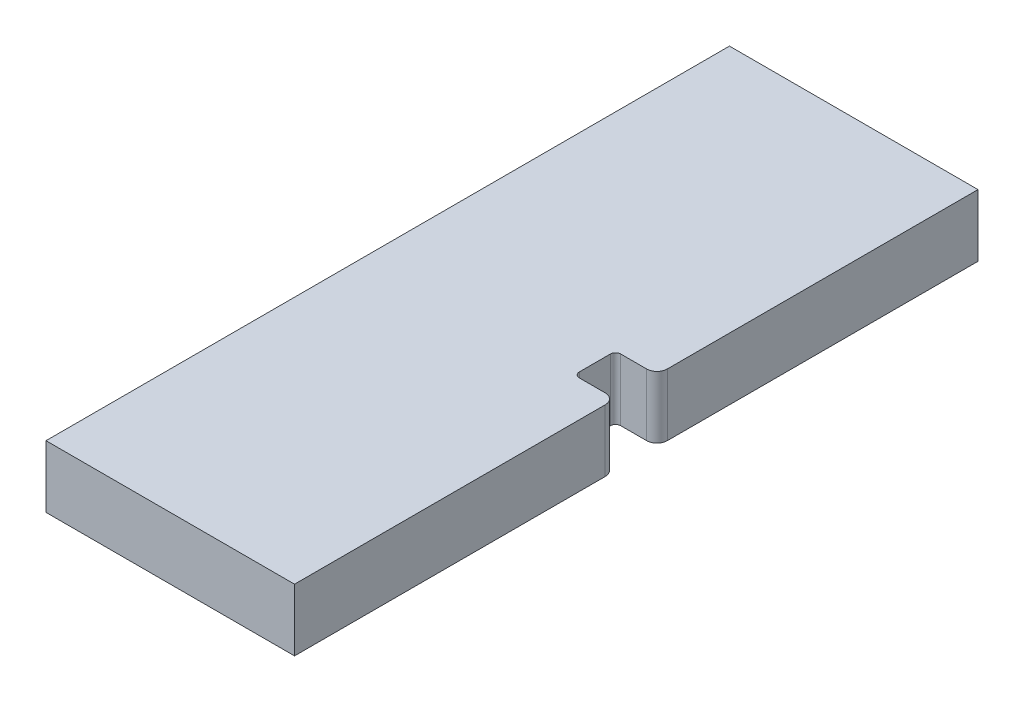
ISO-10303-21;
HEADER;
FILE_DESCRIPTION(('STEP AP214'),'2;1');
FILE_NAME('part.step','',(''),(''),'','','');
FILE_SCHEMA(('AUTOMOTIVE_DESIGN { 1 0 10303 214 1 1 1 1 }'));
ENDSEC;
DATA;
#1=APPLICATION_CONTEXT('core data for automotive mechanical design processes');
#2=APPLICATION_PROTOCOL_DEFINITION('international standard','automotive_design',2000,#1);
#3=PRODUCT_CONTEXT('',#1,'mechanical');
#4=PRODUCT('Part','Part','',(#3));
#5=PRODUCT_RELATED_PRODUCT_CATEGORY('part','',(#4));
#6=PRODUCT_DEFINITION_FORMATION('','',#4);
#7=PRODUCT_DEFINITION_CONTEXT('part definition',#1,'design');
#8=PRODUCT_DEFINITION('design','',#6,#7);
#9=PRODUCT_DEFINITION_SHAPE('','',#8);
#10=(LENGTH_UNIT() NAMED_UNIT(*) SI_UNIT(.MILLI.,.METRE.));
#11=(NAMED_UNIT(*) PLANE_ANGLE_UNIT() SI_UNIT($,.RADIAN.));
#12=(NAMED_UNIT(*) SI_UNIT($,.STERADIAN.) SOLID_ANGLE_UNIT());
#13=UNCERTAINTY_MEASURE_WITH_UNIT(LENGTH_MEASURE(1.E-05),#10,'distance_accuracy_value','');
#14=(GEOMETRIC_REPRESENTATION_CONTEXT(3) GLOBAL_UNCERTAINTY_ASSIGNED_CONTEXT((#13)) GLOBAL_UNIT_ASSIGNED_CONTEXT((#10,
#11,#12)) REPRESENTATION_CONTEXT('',''));
#15=CARTESIAN_POINT('',(0.,0.,0.));
#16=DIRECTION('',(0.,0.,1.));
#17=DIRECTION('',(1.,0.,0.));
#18=AXIS2_PLACEMENT_3D('',#15,#16,#17);
#19=CARTESIAN_POINT('',(20.295,5.17,5.775));
#20=DIRECTION('',(0.,-1.,0.));
#21=DIRECTION('',(0.,0.,-1.));
#22=AXIS2_PLACEMENT_3D('',#19,#20,#21);
#23=CYLINDRICAL_SURFACE('',#22,0.025);
#24=DIRECTION('',(0.,1.,0.));
#25=VECTOR('',#24,1.);
#26=CARTESIAN_POINT('',(20.295,5.17,5.8));
#27=LINE('',#26,#25);
#28=CARTESIAN_POINT('',(20.295,5.17,5.8));
#29=VERTEX_POINT('',#28);
#30=CARTESIAN_POINT('',(20.295,4.87,5.8));
#31=VERTEX_POINT('',#30);
#32=EDGE_CURVE('E186',#29,#31,#27,.F.);
#33=ORIENTED_EDGE('',*,*,#32,.T.);
#34=CARTESIAN_POINT('',(20.295,4.87,5.775));
#35=DIRECTION('',(0.,-1.,0.));
#36=DIRECTION('',(0.,0.,-1.));
#37=AXIS2_PLACEMENT_3D('',#34,#35,#36);
#38=CIRCLE('',#37,0.025);
#39=CARTESIAN_POINT('',(20.27,4.87,5.775));
#40=VERTEX_POINT('',#39);
#41=EDGE_CURVE('E215',#31,#40,#38,.T.);
#42=ORIENTED_EDGE('',*,*,#41,.T.);
#43=DIRECTION('',(0.,1.,0.));
#44=VECTOR('',#43,1.);
#45=CARTESIAN_POINT('',(20.27,5.17,5.775));
#46=LINE('',#45,#44);
#47=CARTESIAN_POINT('',(20.27,5.17,5.775));
#48=VERTEX_POINT('',#47);
#49=EDGE_CURVE('E185',#40,#48,#46,.T.);
#50=ORIENTED_EDGE('',*,*,#49,.T.);
#51=CARTESIAN_POINT('',(20.295,5.17,5.775));
#52=DIRECTION('',(0.,-1.,0.));
#53=DIRECTION('',(0.,0.,-1.));
#54=AXIS2_PLACEMENT_3D('',#51,#52,#53);
#55=CIRCLE('',#54,0.025);
#56=EDGE_CURVE('E20',#29,#48,#55,.T.);
#57=ORIENTED_EDGE('',*,*,#56,.F.);
#58=EDGE_LOOP('',(#33,#42,#50,#57));
#59=FACE_BOUND('',#58,.T.);
#60=ADVANCED_FACE('F17',(#59),#23,.F.);
#61=CARTESIAN_POINT('',(19.87,4.87,5.7));
#62=DIRECTION('',(0.,1.,0.));
#63=DIRECTION('',(0.,0.,1.));
#64=AXIS2_PLACEMENT_3D('',#61,#62,#63);
#65=PLANE('',#64);
#66=DIRECTION('',(-1.,0.,0.));
#67=VECTOR('',#66,1.);
#68=CARTESIAN_POINT('',(20.27,4.87,5.6));
#69=LINE('',#68,#67);
#70=CARTESIAN_POINT('',(20.42,4.87,5.6));
#71=VERTEX_POINT('',#70);
#72=CARTESIAN_POINT('',(20.295,4.87,5.6));
#73=VERTEX_POINT('',#72);
#74=EDGE_CURVE('E178',#71,#73,#69,.T.);
#75=ORIENTED_EDGE('',*,*,#74,.T.);
#76=CARTESIAN_POINT('',(20.295,4.87,5.625));
#77=DIRECTION('',(0.,-1.,0.));
#78=DIRECTION('',(0.,0.,-1.));
#79=AXIS2_PLACEMENT_3D('',#76,#77,#78);
#80=CIRCLE('',#79,0.025);
#81=CARTESIAN_POINT('',(20.27,4.87,5.625));
#82=VERTEX_POINT('',#81);
#83=EDGE_CURVE('E214',#73,#82,#80,.F.);
#84=ORIENTED_EDGE('',*,*,#83,.T.);
#85=DIRECTION('',(0.,0.,1.));
#86=VECTOR('',#85,1.);
#87=CARTESIAN_POINT('',(20.27,4.87,5.8));
#88=LINE('',#87,#86);
#89=EDGE_CURVE('E182',#82,#40,#88,.T.);
#90=ORIENTED_EDGE('',*,*,#89,.T.);
#91=ORIENTED_EDGE('',*,*,#41,.F.);
#92=DIRECTION('',(1.,0.,0.));
#93=VECTOR('',#92,1.);
#94=CARTESIAN_POINT('',(20.47,4.87,5.8));
#95=LINE('',#94,#93);
#96=CARTESIAN_POINT('',(20.42,4.87,5.8));
#97=VERTEX_POINT('',#96);
#98=EDGE_CURVE('E187',#31,#97,#95,.T.);
#99=ORIENTED_EDGE('',*,*,#98,.T.);
#100=CARTESIAN_POINT('',(20.42,4.87,5.85));
#101=DIRECTION('',(0.,1.,0.));
#102=DIRECTION('',(0.,0.,1.));
#103=AXIS2_PLACEMENT_3D('',#100,#101,#102);
#104=CIRCLE('',#103,0.05);
#105=CARTESIAN_POINT('',(20.47,4.87,5.85));
#106=VERTEX_POINT('',#105);
#107=EDGE_CURVE('E189',#106,#97,#104,.T.);
#108=ORIENTED_EDGE('',*,*,#107,.F.);
#109=DIRECTION('',(0.,0.,-1.));
#110=VECTOR('',#109,1.);
#111=CARTESIAN_POINT('',(20.47,4.87,7.35));
#112=LINE('',#111,#110);
#113=CARTESIAN_POINT('',(20.47,4.87,7.35));
#114=VERTEX_POINT('',#113);
#115=EDGE_CURVE('E131',#114,#106,#112,.T.);
#116=ORIENTED_EDGE('',*,*,#115,.F.);
#117=DIRECTION('',(1.,0.,0.));
#118=VECTOR('',#117,1.);
#119=CARTESIAN_POINT('',(19.27,4.87,7.35));
#120=LINE('',#119,#118);
#121=CARTESIAN_POINT('',(19.27,4.87,7.35));
#122=VERTEX_POINT('',#121);
#123=EDGE_CURVE('E128',#122,#114,#120,.T.);
#124=ORIENTED_EDGE('',*,*,#123,.F.);
#125=DIRECTION('',(0.,0.,1.));
#126=VECTOR('',#125,1.);
#127=CARTESIAN_POINT('',(19.27,4.87,4.05));
#128=LINE('',#127,#126);
#129=CARTESIAN_POINT('',(19.27,4.87,4.05));
#130=VERTEX_POINT('',#129);
#131=EDGE_CURVE('E162',#130,#122,#128,.T.);
#132=ORIENTED_EDGE('',*,*,#131,.F.);
#133=DIRECTION('',(-1.,0.,0.));
#134=VECTOR('',#133,1.);
#135=CARTESIAN_POINT('',(20.47,4.87,4.05));
#136=LINE('',#135,#134);
#137=CARTESIAN_POINT('',(20.47,4.87,4.05));
#138=VERTEX_POINT('',#137);
#139=EDGE_CURVE('E100',#138,#130,#136,.T.);
#140=ORIENTED_EDGE('',*,*,#139,.F.);
#141=DIRECTION('',(0.,0.,-1.));
#142=VECTOR('',#141,1.);
#143=CARTESIAN_POINT('',(20.47,4.87,7.35));
#144=LINE('',#143,#142);
#145=CARTESIAN_POINT('',(20.47,4.87,5.55));
#146=VERTEX_POINT('',#145);
#147=EDGE_CURVE('E177',#146,#138,#144,.T.);
#148=ORIENTED_EDGE('',*,*,#147,.F.);
#149=CARTESIAN_POINT('',(20.42,4.87,5.55));
#150=DIRECTION('',(0.,-1.,0.));
#151=DIRECTION('',(0.,0.,-1.));
#152=AXIS2_PLACEMENT_3D('',#149,#150,#151);
#153=CIRCLE('',#152,0.05);
#154=EDGE_CURVE('E93',#71,#146,#153,.F.);
#155=ORIENTED_EDGE('',*,*,#154,.F.);
#156=EDGE_LOOP('',(#75,#84,#90,#91,#99,#108,#116,#124,#132,#140,#148,#155));
#157=FACE_BOUND('',#156,.T.);
#158=ADVANCED_FACE('F245',(#157),#65,.F.);
#159=CARTESIAN_POINT('',(20.295,5.17,5.625));
#160=DIRECTION('',(0.,-1.,0.));
#161=DIRECTION('',(0.,0.,-1.));
#162=AXIS2_PLACEMENT_3D('',#159,#160,#161);
#163=CYLINDRICAL_SURFACE('',#162,0.025);
#164=DIRECTION('',(0.,1.,0.));
#165=VECTOR('',#164,1.);
#166=CARTESIAN_POINT('',(20.27,5.17,5.625));
#167=LINE('',#166,#165);
#168=CARTESIAN_POINT('',(20.27,5.17,5.625));
#169=VERTEX_POINT('',#168);
#170=EDGE_CURVE('E221',#169,#82,#167,.F.);
#171=ORIENTED_EDGE('',*,*,#170,.T.);
#172=ORIENTED_EDGE('',*,*,#83,.F.);
#173=DIRECTION('',(0.,1.,0.));
#174=VECTOR('',#173,1.);
#175=CARTESIAN_POINT('',(20.295,5.17,5.6));
#176=LINE('',#175,#174);
#177=CARTESIAN_POINT('',(20.295,5.17,5.6));
#178=VERTEX_POINT('',#177);
#179=EDGE_CURVE('E180',#73,#178,#176,.T.);
#180=ORIENTED_EDGE('',*,*,#179,.T.);
#181=CARTESIAN_POINT('',(20.295,5.17,5.625));
#182=DIRECTION('',(0.,-1.,0.));
#183=DIRECTION('',(0.,0.,-1.));
#184=AXIS2_PLACEMENT_3D('',#181,#182,#183);
#185=CIRCLE('',#184,0.025);
#186=EDGE_CURVE('E34',#169,#178,#185,.T.);
#187=ORIENTED_EDGE('',*,*,#186,.F.);
#188=EDGE_LOOP('',(#171,#172,#180,#187));
#189=FACE_BOUND('',#188,.T.);
#190=ADVANCED_FACE('F250',(#189),#163,.F.);
#191=CARTESIAN_POINT('',(20.42,5.02,5.55));
#192=DIRECTION('',(0.,-1.,0.));
#193=DIRECTION('',(0.,0.,-1.));
#194=AXIS2_PLACEMENT_3D('',#191,#192,#193);
#195=CYLINDRICAL_SURFACE('',#194,0.05);
#196=CARTESIAN_POINT('',(20.42,5.17,5.55));
#197=DIRECTION('',(0.,-1.,0.));
#198=DIRECTION('',(0.,0.,-1.));
#199=AXIS2_PLACEMENT_3D('',#196,#197,#198);
#200=CIRCLE('',#199,0.05);
#201=CARTESIAN_POINT('',(20.42,5.17,5.6));
#202=VERTEX_POINT('',#201);
#203=CARTESIAN_POINT('',(20.47,5.17,5.55));
#204=VERTEX_POINT('',#203);
#205=EDGE_CURVE('E208',#202,#204,#200,.F.);
#206=ORIENTED_EDGE('',*,*,#205,.F.);
#207=DIRECTION('',(0.,1.,0.));
#208=VECTOR('',#207,1.);
#209=CARTESIAN_POINT('',(20.42,5.17,5.6));
#210=LINE('',#209,#208);
#211=EDGE_CURVE('E181',#202,#71,#210,.F.);
#212=ORIENTED_EDGE('',*,*,#211,.T.);
#213=ORIENTED_EDGE('',*,*,#154,.T.);
#214=DIRECTION('',(0.,1.,0.));
#215=VECTOR('',#214,1.);
#216=CARTESIAN_POINT('',(20.47,4.87,5.55));
#217=LINE('',#216,#215);
#218=EDGE_CURVE('E174',#204,#146,#217,.F.);
#219=ORIENTED_EDGE('',*,*,#218,.F.);
#220=EDGE_LOOP('',(#206,#212,#213,#219));
#221=FACE_BOUND('',#220,.T.);
#222=ADVANCED_FACE('F256',(#221),#195,.T.);
#223=CARTESIAN_POINT('',(20.47,4.87,7.35));
#224=DIRECTION('',(1.,0.,0.));
#225=DIRECTION('',(0.,0.,-1.));
#226=AXIS2_PLACEMENT_3D('',#223,#224,#225);
#227=PLANE('',#226);
#228=DIRECTION('',(0.,1.,0.));
#229=VECTOR('',#228,1.);
#230=CARTESIAN_POINT('',(20.47,4.87,4.05));
#231=LINE('',#230,#229);
#232=CARTESIAN_POINT('',(20.47,5.17,4.05));
#233=VERTEX_POINT('',#232);
#234=EDGE_CURVE('E169',#233,#138,#231,.F.);
#235=ORIENTED_EDGE('',*,*,#234,.F.);
#236=DIRECTION('',(0.,0.,1.));
#237=VECTOR('',#236,1.);
#238=CARTESIAN_POINT('',(20.47,5.17,5.7));
#239=LINE('',#238,#237);
#240=EDGE_CURVE('E166',#204,#233,#239,.F.);
#241=ORIENTED_EDGE('',*,*,#240,.F.);
#242=ORIENTED_EDGE('',*,*,#218,.T.);
#243=ORIENTED_EDGE('',*,*,#147,.T.);
#244=EDGE_LOOP('',(#235,#241,#242,#243));
#245=FACE_BOUND('',#244,.T.);
#246=ADVANCED_FACE('F258',(#245),#227,.T.);
#247=CARTESIAN_POINT('',(20.47,4.87,4.05));
#248=DIRECTION('',(0.,0.,-1.));
#249=DIRECTION('',(-1.,0.,0.));
#250=AXIS2_PLACEMENT_3D('',#247,#248,#249);
#251=PLANE('',#250);
#252=DIRECTION('',(1.,0.,0.));
#253=VECTOR('',#252,1.);
#254=CARTESIAN_POINT('',(19.87,5.17,4.05));
#255=LINE('',#254,#253);
#256=CARTESIAN_POINT('',(19.27,5.17,4.05));
#257=VERTEX_POINT('',#256);
#258=EDGE_CURVE('E147',#233,#257,#255,.F.);
#259=ORIENTED_EDGE('',*,*,#258,.F.);
#260=ORIENTED_EDGE('',*,*,#234,.T.);
#261=ORIENTED_EDGE('',*,*,#139,.T.);
#262=DIRECTION('',(0.,1.,0.));
#263=VECTOR('',#262,1.);
#264=CARTESIAN_POINT('',(19.27,4.87,4.05));
#265=LINE('',#264,#263);
#266=EDGE_CURVE('E159',#257,#130,#265,.F.);
#267=ORIENTED_EDGE('',*,*,#266,.F.);
#268=EDGE_LOOP('',(#259,#260,#261,#267));
#269=FACE_BOUND('',#268,.T.);
#270=ADVANCED_FACE('F261',(#269),#251,.T.);
#271=CARTESIAN_POINT('',(19.27,4.87,4.05));
#272=DIRECTION('',(-1.,0.,0.));
#273=DIRECTION('',(0.,0.,1.));
#274=AXIS2_PLACEMENT_3D('',#271,#272,#273);
#275=PLANE('',#274);
#276=DIRECTION('',(0.,0.,1.));
#277=VECTOR('',#276,1.);
#278=CARTESIAN_POINT('',(19.27,5.17,5.7));
#279=LINE('',#278,#277);
#280=CARTESIAN_POINT('',(19.27,5.17,7.35));
#281=VERTEX_POINT('',#280);
#282=EDGE_CURVE('E145',#257,#281,#279,.T.);
#283=ORIENTED_EDGE('',*,*,#282,.F.);
#284=ORIENTED_EDGE('',*,*,#266,.T.);
#285=ORIENTED_EDGE('',*,*,#131,.T.);
#286=DIRECTION('',(0.,1.,0.));
#287=VECTOR('',#286,1.);
#288=CARTESIAN_POINT('',(19.27,4.87,7.35));
#289=LINE('',#288,#287);
#290=EDGE_CURVE('E132',#281,#122,#289,.F.);
#291=ORIENTED_EDGE('',*,*,#290,.F.);
#292=EDGE_LOOP('',(#283,#284,#285,#291));
#293=FACE_BOUND('',#292,.T.);
#294=ADVANCED_FACE('F263',(#293),#275,.T.);
#295=CARTESIAN_POINT('',(19.27,4.87,7.35));
#296=DIRECTION('',(0.,0.,1.));
#297=DIRECTION('',(1.,0.,0.));
#298=AXIS2_PLACEMENT_3D('',#295,#296,#297);
#299=PLANE('',#298);
#300=DIRECTION('',(1.,0.,0.));
#301=VECTOR('',#300,1.);
#302=CARTESIAN_POINT('',(19.87,5.17,7.35));
#303=LINE('',#302,#301);
#304=CARTESIAN_POINT('',(20.47,5.17,7.35));
#305=VERTEX_POINT('',#304);
#306=EDGE_CURVE('E126',#281,#305,#303,.T.);
#307=ORIENTED_EDGE('',*,*,#306,.F.);
#308=ORIENTED_EDGE('',*,*,#290,.T.);
#309=ORIENTED_EDGE('',*,*,#123,.T.);
#310=DIRECTION('',(0.,1.,0.));
#311=VECTOR('',#310,1.);
#312=CARTESIAN_POINT('',(20.47,4.87,7.35));
#313=LINE('',#312,#311);
#314=EDGE_CURVE('E121',#305,#114,#313,.F.);
#315=ORIENTED_EDGE('',*,*,#314,.F.);
#316=EDGE_LOOP('',(#307,#308,#309,#315));
#317=FACE_BOUND('',#316,.T.);
#318=ADVANCED_FACE('F123',(#317),#299,.T.);
#319=CARTESIAN_POINT('',(20.47,4.87,7.35));
#320=DIRECTION('',(1.,0.,0.));
#321=DIRECTION('',(0.,0.,-1.));
#322=AXIS2_PLACEMENT_3D('',#319,#320,#321);
#323=PLANE('',#322);
#324=ORIENTED_EDGE('',*,*,#314,.T.);
#325=ORIENTED_EDGE('',*,*,#115,.T.);
#326=DIRECTION('',(0.,1.,0.));
#327=VECTOR('',#326,1.);
#328=CARTESIAN_POINT('',(20.47,5.02,5.85));
#329=LINE('',#328,#327);
#330=CARTESIAN_POINT('',(20.47,5.17,5.85));
#331=VERTEX_POINT('',#330);
#332=EDGE_CURVE('E138',#331,#106,#329,.F.);
#333=ORIENTED_EDGE('',*,*,#332,.F.);
#334=DIRECTION('',(0.,0.,1.));
#335=VECTOR('',#334,1.);
#336=CARTESIAN_POINT('',(20.47,5.17,5.7));
#337=LINE('',#336,#335);
#338=EDGE_CURVE('E135',#305,#331,#337,.F.);
#339=ORIENTED_EDGE('',*,*,#338,.F.);
#340=EDGE_LOOP('',(#324,#325,#333,#339));
#341=FACE_BOUND('',#340,.T.);
#342=ADVANCED_FACE('F136',(#341),#323,.T.);
#343=CARTESIAN_POINT('',(20.42,5.02,5.85));
#344=DIRECTION('',(0.,1.,0.));
#345=DIRECTION('',(0.,0.,1.));
#346=AXIS2_PLACEMENT_3D('',#343,#344,#345);
#347=CYLINDRICAL_SURFACE('',#346,0.05);
#348=ORIENTED_EDGE('',*,*,#107,.T.);
#349=DIRECTION('',(0.,1.,0.));
#350=VECTOR('',#349,1.);
#351=CARTESIAN_POINT('',(20.42,5.17,5.8));
#352=LINE('',#351,#350);
#353=CARTESIAN_POINT('',(20.42,5.17,5.8));
#354=VERTEX_POINT('',#353);
#355=EDGE_CURVE('E69',#97,#354,#352,.T.);
#356=ORIENTED_EDGE('',*,*,#355,.T.);
#357=CARTESIAN_POINT('',(20.42,5.17,5.85));
#358=DIRECTION('',(0.,1.,0.));
#359=DIRECTION('',(0.,0.,1.));
#360=AXIS2_PLACEMENT_3D('',#357,#358,#359);
#361=CIRCLE('',#360,0.05);
#362=EDGE_CURVE('E140',#331,#354,#361,.T.);
#363=ORIENTED_EDGE('',*,*,#362,.F.);
#364=ORIENTED_EDGE('',*,*,#332,.T.);
#365=EDGE_LOOP('',(#348,#356,#363,#364));
#366=FACE_BOUND('',#365,.T.);
#367=ADVANCED_FACE('F240',(#366),#347,.T.);
#368=CARTESIAN_POINT('',(20.47,5.17,5.8));
#369=DIRECTION('',(0.,0.,1.));
#370=DIRECTION('',(1.,0.,0.));
#371=AXIS2_PLACEMENT_3D('',#368,#369,#370);
#372=PLANE('',#371);
#373=DIRECTION('',(1.,0.,0.));
#374=VECTOR('',#373,1.);
#375=CARTESIAN_POINT('',(19.87,5.17,5.8));
#376=LINE('',#375,#374);
#377=EDGE_CURVE('E207',#354,#29,#376,.F.);
#378=ORIENTED_EDGE('',*,*,#377,.F.);
#379=ORIENTED_EDGE('',*,*,#355,.F.);
#380=ORIENTED_EDGE('',*,*,#98,.F.);
#381=ORIENTED_EDGE('',*,*,#32,.F.);
#382=EDGE_LOOP('',(#378,#379,#380,#381));
#383=FACE_BOUND('',#382,.T.);
#384=ADVANCED_FACE('F244',(#383),#372,.F.);
#385=CARTESIAN_POINT('',(20.27,5.17,5.8));
#386=DIRECTION('',(-1.,0.,0.));
#387=DIRECTION('',(0.,0.,1.));
#388=AXIS2_PLACEMENT_3D('',#385,#386,#387);
#389=PLANE('',#388);
#390=DIRECTION('',(0.,0.,1.));
#391=VECTOR('',#390,1.);
#392=CARTESIAN_POINT('',(20.27,5.17,5.7));
#393=LINE('',#392,#391);
#394=EDGE_CURVE('E26',#48,#169,#393,.F.);
#395=ORIENTED_EDGE('',*,*,#394,.F.);
#396=ORIENTED_EDGE('',*,*,#49,.F.);
#397=ORIENTED_EDGE('',*,*,#89,.F.);
#398=ORIENTED_EDGE('',*,*,#170,.F.);
#399=EDGE_LOOP('',(#395,#396,#397,#398));
#400=FACE_BOUND('',#399,.T.);
#401=ADVANCED_FACE('F224',(#400),#389,.F.);
#402=CARTESIAN_POINT('',(20.27,5.17,5.6));
#403=DIRECTION('',(0.,0.,-1.));
#404=DIRECTION('',(-1.,0.,0.));
#405=AXIS2_PLACEMENT_3D('',#402,#403,#404);
#406=PLANE('',#405);
#407=ORIENTED_EDGE('',*,*,#74,.F.);
#408=ORIENTED_EDGE('',*,*,#211,.F.);
#409=DIRECTION('',(1.,0.,0.));
#410=VECTOR('',#409,1.);
#411=CARTESIAN_POINT('',(19.87,5.17,5.6));
#412=LINE('',#411,#410);
#413=EDGE_CURVE('E11',#178,#202,#412,.T.);
#414=ORIENTED_EDGE('',*,*,#413,.F.);
#415=ORIENTED_EDGE('',*,*,#179,.F.);
#416=EDGE_LOOP('',(#407,#408,#414,#415));
#417=FACE_BOUND('',#416,.T.);
#418=ADVANCED_FACE('F254',(#417),#406,.F.);
#419=CARTESIAN_POINT('',(19.87,5.17,5.7));
#420=DIRECTION('',(0.,1.,0.));
#421=DIRECTION('',(0.,0.,1.));
#422=AXIS2_PLACEMENT_3D('',#419,#420,#421);
#423=PLANE('',#422);
#424=ORIENTED_EDGE('',*,*,#186,.T.);
#425=ORIENTED_EDGE('',*,*,#413,.T.);
#426=ORIENTED_EDGE('',*,*,#205,.T.);
#427=ORIENTED_EDGE('',*,*,#240,.T.);
#428=ORIENTED_EDGE('',*,*,#258,.T.);
#429=ORIENTED_EDGE('',*,*,#282,.T.);
#430=ORIENTED_EDGE('',*,*,#306,.T.);
#431=ORIENTED_EDGE('',*,*,#338,.T.);
#432=ORIENTED_EDGE('',*,*,#362,.T.);
#433=ORIENTED_EDGE('',*,*,#377,.T.);
#434=ORIENTED_EDGE('',*,*,#56,.T.);
#435=ORIENTED_EDGE('',*,*,#394,.T.);
#436=EDGE_LOOP('',(#424,#425,#426,#427,#428,#429,#430,#431,#432,#433,#434,#435));
#437=FACE_BOUND('',#436,.T.);
#438=ADVANCED_FACE('F142',(#437),#423,.T.);
#439=CLOSED_SHELL('',(#60,#158,#190,#222,#246,#270,#294,#318,#342,#367,#384,#401,#418,#438));
#440=MANIFOLD_SOLID_BREP('B1',#439);
#441=ADVANCED_BREP_SHAPE_REPRESENTATION('',(#18,#440),#14);
#442=SHAPE_DEFINITION_REPRESENTATION(#9,#441);
ENDSEC;
END-ISO-10303-21;
